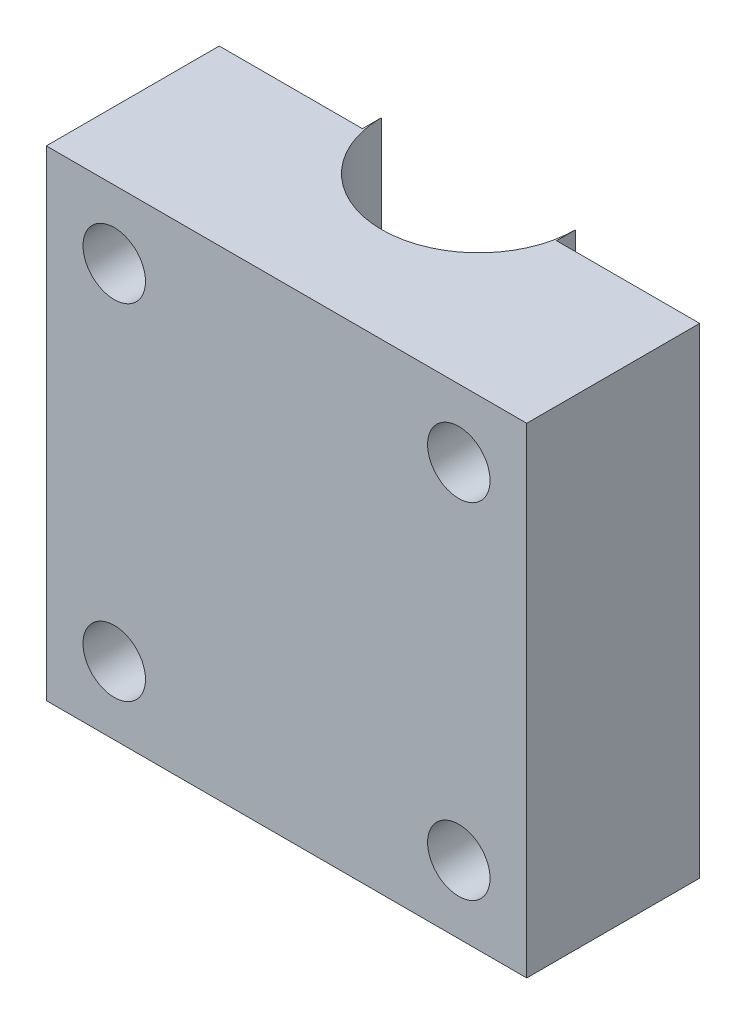
ISO-10303-21;
HEADER;
FILE_DESCRIPTION(('STEP AP214'),'2;1');
FILE_NAME('part.step','',(''),(''),'','','');
FILE_SCHEMA(('AUTOMOTIVE_DESIGN { 1 0 10303 214 1 1 1 1 }'));
ENDSEC;
DATA;
#1=APPLICATION_CONTEXT('core data for automotive mechanical design processes');
#2=APPLICATION_PROTOCOL_DEFINITION('international standard','automotive_design',2000,#1);
#3=PRODUCT_CONTEXT('',#1,'mechanical');
#4=PRODUCT('Part','Part','',(#3));
#5=PRODUCT_RELATED_PRODUCT_CATEGORY('part','',(#4));
#6=PRODUCT_DEFINITION_FORMATION('','',#4);
#7=PRODUCT_DEFINITION_CONTEXT('part definition',#1,'design');
#8=PRODUCT_DEFINITION('design','',#6,#7);
#9=PRODUCT_DEFINITION_SHAPE('','',#8);
#10=(LENGTH_UNIT() NAMED_UNIT(*) SI_UNIT(.MILLI.,.METRE.));
#11=(NAMED_UNIT(*) PLANE_ANGLE_UNIT() SI_UNIT($,.RADIAN.));
#12=(NAMED_UNIT(*) SI_UNIT($,.STERADIAN.) SOLID_ANGLE_UNIT());
#13=UNCERTAINTY_MEASURE_WITH_UNIT(LENGTH_MEASURE(1.E-05),#10,'distance_accuracy_value','');
#14=(GEOMETRIC_REPRESENTATION_CONTEXT(3) GLOBAL_UNCERTAINTY_ASSIGNED_CONTEXT((#13)) GLOBAL_UNIT_ASSIGNED_CONTEXT((#10,
#11,#12)) REPRESENTATION_CONTEXT('',''));
#15=CARTESIAN_POINT('',(0.,0.,0.));
#16=DIRECTION('',(0.,0.,1.));
#17=DIRECTION('',(1.,0.,0.));
#18=AXIS2_PLACEMENT_3D('',#15,#16,#17);
#19=CARTESIAN_POINT('',(-12.5,-12.5,10.));
#20=DIRECTION('',(1.,0.,0.));
#21=DIRECTION('',(0.,0.,-1.));
#22=AXIS2_PLACEMENT_3D('',#19,#20,#21);
#23=PLANE('',#22);
#24=DIRECTION('',(0.,1.,0.));
#25=VECTOR('',#24,1.);
#26=CARTESIAN_POINT('',(-12.5,12.5,1.));
#27=LINE('',#26,#25);
#28=CARTESIAN_POINT('',(-12.5,-12.5,1.));
#29=VERTEX_POINT('',#28);
#30=CARTESIAN_POINT('',(-12.5,12.5,1.));
#31=VERTEX_POINT('',#30);
#32=EDGE_CURVE('E122',#29,#31,#27,.T.);
#33=ORIENTED_EDGE('',*,*,#32,.F.);
#34=DIRECTION('',(0.,0.,-1.));
#35=VECTOR('',#34,1.);
#36=CARTESIAN_POINT('',(-12.5,-12.5,10.));
#37=LINE('',#36,#35);
#38=CARTESIAN_POINT('',(-12.5,-12.5,10.));
#39=VERTEX_POINT('',#38);
#40=EDGE_CURVE('E121',#39,#29,#37,.T.);
#41=ORIENTED_EDGE('',*,*,#40,.F.);
#42=DIRECTION('',(0.,-1.,0.));
#43=VECTOR('',#42,1.);
#44=CARTESIAN_POINT('',(-12.5,-12.5,10.));
#45=LINE('',#44,#43);
#46=CARTESIAN_POINT('',(-12.5,12.5,10.));
#47=VERTEX_POINT('',#46);
#48=EDGE_CURVE('E55',#47,#39,#45,.T.);
#49=ORIENTED_EDGE('',*,*,#48,.F.);
#50=DIRECTION('',(0.,0.,-1.));
#51=VECTOR('',#50,1.);
#52=CARTESIAN_POINT('',(-12.5,12.5,10.));
#53=LINE('',#52,#51);
#54=EDGE_CURVE('E177',#47,#31,#53,.T.);
#55=ORIENTED_EDGE('',*,*,#54,.T.);
#56=EDGE_LOOP('',(#33,#41,#49,#55));
#57=FACE_BOUND('',#56,.T.);
#58=ADVANCED_FACE('F33',(#57),#23,.F.);
#59=CARTESIAN_POINT('',(-8.96446609406727,8.96446609406726,0.));
#60=DIRECTION('',(0.,0.,1.));
#61=DIRECTION('',(1.,0.,0.));
#62=AXIS2_PLACEMENT_3D('',#59,#60,#61);
#63=CYLINDRICAL_SURFACE('',#62,1.625);
#64=CARTESIAN_POINT('',(-8.96446609406727,8.96446609406726,10.));
#65=DIRECTION('',(0.,0.,1.));
#66=DIRECTION('',(1.,0.,0.));
#67=AXIS2_PLACEMENT_3D('',#64,#65,#66);
#68=CIRCLE('',#67,1.625);
#69=CARTESIAN_POINT('',(-7.33946609406727,8.96446609406726,10.));
#70=VERTEX_POINT('',#69);
#71=EDGE_CURVE('E159',#70,#70,#68,.T.);
#72=ORIENTED_EDGE('',*,*,#71,.T.);
#73=EDGE_LOOP('',(#72));
#74=FACE_BOUND('',#73,.T.);
#75=CARTESIAN_POINT('',(-8.96446609406727,8.96446609406726,1.));
#76=DIRECTION('',(0.,0.,-1.));
#77=DIRECTION('',(-1.,0.,0.));
#78=AXIS2_PLACEMENT_3D('',#75,#76,#77);
#79=CIRCLE('',#78,1.625);
#80=CARTESIAN_POINT('',(-10.5894660940673,8.96446609406726,1.));
#81=VERTEX_POINT('',#80);
#82=EDGE_CURVE('E128',#81,#81,#79,.F.);
#83=ORIENTED_EDGE('',*,*,#82,.F.);
#84=EDGE_LOOP('',(#83));
#85=FACE_BOUND('',#84,.T.);
#86=ADVANCED_FACE('F205',(#74,#85),#63,.F.);
#87=CARTESIAN_POINT('',(-8.96446609406727,-8.96446609406727,0.));
#88=DIRECTION('',(0.,0.,1.));
#89=DIRECTION('',(1.,0.,0.));
#90=AXIS2_PLACEMENT_3D('',#87,#88,#89);
#91=CYLINDRICAL_SURFACE('',#90,1.625);
#92=CARTESIAN_POINT('',(-8.96446609406727,-8.96446609406727,10.));
#93=DIRECTION('',(0.,0.,1.));
#94=DIRECTION('',(1.,0.,0.));
#95=AXIS2_PLACEMENT_3D('',#92,#93,#94);
#96=CIRCLE('',#95,1.625);
#97=CARTESIAN_POINT('',(-7.33946609406727,-8.96446609406727,10.));
#98=VERTEX_POINT('',#97);
#99=EDGE_CURVE('E150',#98,#98,#96,.T.);
#100=ORIENTED_EDGE('',*,*,#99,.T.);
#101=EDGE_LOOP('',(#100));
#102=FACE_BOUND('',#101,.T.);
#103=CARTESIAN_POINT('',(-8.96446609406727,-8.96446609406727,1.));
#104=DIRECTION('',(0.,0.,-1.));
#105=DIRECTION('',(-1.,0.,0.));
#106=AXIS2_PLACEMENT_3D('',#103,#104,#105);
#107=CIRCLE('',#106,1.625);
#108=CARTESIAN_POINT('',(-10.5894660940673,-8.96446609406727,1.));
#109=VERTEX_POINT('',#108);
#110=EDGE_CURVE('E37',#109,#109,#107,.F.);
#111=ORIENTED_EDGE('',*,*,#110,.F.);
#112=EDGE_LOOP('',(#111));
#113=FACE_BOUND('',#112,.T.);
#114=ADVANCED_FACE('F211',(#102,#113),#91,.F.);
#115=CARTESIAN_POINT('',(12.5,-12.5,10.));
#116=DIRECTION('',(-1.,0.,0.));
#117=DIRECTION('',(0.,0.,1.));
#118=AXIS2_PLACEMENT_3D('',#115,#116,#117);
#119=PLANE('',#118);
#120=DIRECTION('',(0.,-1.,0.));
#121=VECTOR('',#120,1.);
#122=CARTESIAN_POINT('',(12.5,12.5,1.));
#123=LINE('',#122,#121);
#124=CARTESIAN_POINT('',(12.5,12.5,1.));
#125=VERTEX_POINT('',#124);
#126=CARTESIAN_POINT('',(12.5,-12.5,1.));
#127=VERTEX_POINT('',#126);
#128=EDGE_CURVE('E131',#125,#127,#123,.T.);
#129=ORIENTED_EDGE('',*,*,#128,.F.);
#130=DIRECTION('',(0.,0.,-1.));
#131=VECTOR('',#130,1.);
#132=CARTESIAN_POINT('',(12.5,12.5,10.));
#133=LINE('',#132,#131);
#134=CARTESIAN_POINT('',(12.5,12.5,10.));
#135=VERTEX_POINT('',#134);
#136=EDGE_CURVE('E180',#135,#125,#133,.T.);
#137=ORIENTED_EDGE('',*,*,#136,.F.);
#138=DIRECTION('',(0.,1.,0.));
#139=VECTOR('',#138,1.);
#140=CARTESIAN_POINT('',(12.5,-12.5,10.));
#141=LINE('',#140,#139);
#142=CARTESIAN_POINT('',(12.5,-12.5,10.));
#143=VERTEX_POINT('',#142);
#144=EDGE_CURVE('E165',#143,#135,#141,.T.);
#145=ORIENTED_EDGE('',*,*,#144,.F.);
#146=DIRECTION('',(0.,0.,-1.));
#147=VECTOR('',#146,1.);
#148=CARTESIAN_POINT('',(12.5,-12.5,10.));
#149=LINE('',#148,#147);
#150=EDGE_CURVE('E173',#143,#127,#149,.T.);
#151=ORIENTED_EDGE('',*,*,#150,.T.);
#152=EDGE_LOOP('',(#129,#137,#145,#151));
#153=FACE_BOUND('',#152,.T.);
#154=ADVANCED_FACE('F35',(#153),#119,.F.);
#155=CARTESIAN_POINT('',(8.96446609406726,8.96446609406726,0.));
#156=DIRECTION('',(0.,0.,1.));
#157=DIRECTION('',(1.,0.,0.));
#158=AXIS2_PLACEMENT_3D('',#155,#156,#157);
#159=CYLINDRICAL_SURFACE('',#158,1.625);
#160=CARTESIAN_POINT('',(8.96446609406726,8.96446609406726,10.));
#161=DIRECTION('',(0.,0.,1.));
#162=DIRECTION('',(1.,0.,0.));
#163=AXIS2_PLACEMENT_3D('',#160,#161,#162);
#164=CIRCLE('',#163,1.625);
#165=CARTESIAN_POINT('',(10.5894660940673,8.96446609406726,10.));
#166=VERTEX_POINT('',#165);
#167=EDGE_CURVE('E156',#166,#166,#164,.T.);
#168=ORIENTED_EDGE('',*,*,#167,.T.);
#169=EDGE_LOOP('',(#168));
#170=FACE_BOUND('',#169,.T.);
#171=CARTESIAN_POINT('',(8.96446609406726,8.96446609406726,1.));
#172=DIRECTION('',(0.,0.,-1.));
#173=DIRECTION('',(-1.,0.,0.));
#174=AXIS2_PLACEMENT_3D('',#171,#172,#173);
#175=CIRCLE('',#174,1.625);
#176=CARTESIAN_POINT('',(7.33946609406726,8.96446609406726,1.));
#177=VERTEX_POINT('',#176);
#178=EDGE_CURVE('E147',#177,#177,#175,.F.);
#179=ORIENTED_EDGE('',*,*,#178,.F.);
#180=EDGE_LOOP('',(#179));
#181=FACE_BOUND('',#180,.T.);
#182=ADVANCED_FACE('F193',(#170,#181),#159,.F.);
#183=CARTESIAN_POINT('',(8.96446609406726,-8.96446609406727,0.));
#184=DIRECTION('',(0.,0.,1.));
#185=DIRECTION('',(1.,0.,0.));
#186=AXIS2_PLACEMENT_3D('',#183,#184,#185);
#187=CYLINDRICAL_SURFACE('',#186,1.625);
#188=CARTESIAN_POINT('',(8.96446609406726,-8.96446609406727,10.));
#189=DIRECTION('',(0.,0.,1.));
#190=DIRECTION('',(1.,0.,0.));
#191=AXIS2_PLACEMENT_3D('',#188,#189,#190);
#192=CIRCLE('',#191,1.625);
#193=CARTESIAN_POINT('',(10.5894660940673,-8.96446609406727,10.));
#194=VERTEX_POINT('',#193);
#195=EDGE_CURVE('E153',#194,#194,#192,.T.);
#196=ORIENTED_EDGE('',*,*,#195,.T.);
#197=EDGE_LOOP('',(#196));
#198=FACE_BOUND('',#197,.T.);
#199=CARTESIAN_POINT('',(8.96446609406726,-8.96446609406727,1.));
#200=DIRECTION('',(0.,0.,-1.));
#201=DIRECTION('',(-1.,0.,0.));
#202=AXIS2_PLACEMENT_3D('',#199,#200,#201);
#203=CIRCLE('',#202,1.625);
#204=CARTESIAN_POINT('',(7.33946609406726,-8.96446609406727,1.));
#205=VERTEX_POINT('',#204);
#206=EDGE_CURVE('E145',#205,#205,#203,.F.);
#207=ORIENTED_EDGE('',*,*,#206,.F.);
#208=EDGE_LOOP('',(#207));
#209=FACE_BOUND('',#208,.T.);
#210=ADVANCED_FACE('F190',(#198,#209),#187,.F.);
#211=CARTESIAN_POINT('',(-12.5,12.5,10.));
#212=DIRECTION('',(0.,-1.,0.));
#213=DIRECTION('',(0.,0.,-1.));
#214=AXIS2_PLACEMENT_3D('',#211,#212,#213);
#215=PLANE('',#214);
#216=CARTESIAN_POINT('',(0.,12.5,0.));
#217=DIRECTION('',(0.,1.,0.));
#218=DIRECTION('',(0.,0.,1.));
#219=AXIS2_PLACEMENT_3D('',#216,#217,#218);
#220=CIRCLE('',#219,5.05);
#221=CARTESIAN_POINT('',(-5.05,12.5,0.));
#222=VERTEX_POINT('',#221);
#223=CARTESIAN_POINT('',(5.05,12.5,0.));
#224=VERTEX_POINT('',#223);
#225=EDGE_CURVE('E162',#222,#224,#220,.T.);
#226=ORIENTED_EDGE('',*,*,#225,.F.);
#227=DIRECTION('',(0.,0.,-1.));
#228=VECTOR('',#227,1.);
#229=CARTESIAN_POINT('',(-5.05,12.5,1.));
#230=LINE('',#229,#228);
#231=CARTESIAN_POINT('',(-5.05,12.5,1.));
#232=VERTEX_POINT('',#231);
#233=EDGE_CURVE('E108',#232,#222,#230,.T.);
#234=ORIENTED_EDGE('',*,*,#233,.F.);
#235=DIRECTION('',(1.,0.,0.));
#236=VECTOR('',#235,1.);
#237=CARTESIAN_POINT('',(-5.05,12.5,1.));
#238=LINE('',#237,#236);
#239=EDGE_CURVE('E109',#31,#232,#238,.T.);
#240=ORIENTED_EDGE('',*,*,#239,.F.);
#241=ORIENTED_EDGE('',*,*,#54,.F.);
#242=DIRECTION('',(-1.,0.,0.));
#243=VECTOR('',#242,1.);
#244=CARTESIAN_POINT('',(-12.5,12.5,10.));
#245=LINE('',#244,#243);
#246=EDGE_CURVE('E169',#135,#47,#245,.T.);
#247=ORIENTED_EDGE('',*,*,#246,.F.);
#248=ORIENTED_EDGE('',*,*,#136,.T.);
#249=DIRECTION('',(1.,0.,0.));
#250=VECTOR('',#249,1.);
#251=CARTESIAN_POINT('',(12.5,12.5,1.));
#252=LINE('',#251,#250);
#253=CARTESIAN_POINT('',(5.05,12.5,1.));
#254=VERTEX_POINT('',#253);
#255=EDGE_CURVE('E139',#254,#125,#252,.T.);
#256=ORIENTED_EDGE('',*,*,#255,.F.);
#257=DIRECTION('',(0.,0.,-1.));
#258=VECTOR('',#257,1.);
#259=CARTESIAN_POINT('',(5.05,12.5,1.));
#260=LINE('',#259,#258);
#261=EDGE_CURVE('E142',#254,#224,#260,.T.);
#262=ORIENTED_EDGE('',*,*,#261,.T.);
#263=EDGE_LOOP('',(#226,#234,#240,#241,#247,#248,#256,#262));
#264=FACE_BOUND('',#263,.T.);
#265=ADVANCED_FACE('F192',(#264),#215,.F.);
#266=CARTESIAN_POINT('',(-12.5,-12.5,10.));
#267=DIRECTION('',(0.,1.,0.));
#268=DIRECTION('',(0.,0.,1.));
#269=AXIS2_PLACEMENT_3D('',#266,#267,#268);
#270=PLANE('',#269);
#271=DIRECTION('',(-1.,0.,0.));
#272=VECTOR('',#271,1.);
#273=CARTESIAN_POINT('',(-5.05,-12.5,1.));
#274=LINE('',#273,#272);
#275=CARTESIAN_POINT('',(-5.05,-12.5,1.));
#276=VERTEX_POINT('',#275);
#277=EDGE_CURVE('E114',#276,#29,#274,.T.);
#278=ORIENTED_EDGE('',*,*,#277,.F.);
#279=DIRECTION('',(0.,0.,-1.));
#280=VECTOR('',#279,1.);
#281=CARTESIAN_POINT('',(-5.05,-12.5,1.));
#282=LINE('',#281,#280);
#283=CARTESIAN_POINT('',(-5.05,-12.5,0.));
#284=VERTEX_POINT('',#283);
#285=EDGE_CURVE('E99',#276,#284,#282,.T.);
#286=ORIENTED_EDGE('',*,*,#285,.T.);
#287=CARTESIAN_POINT('',(0.,-12.5,0.));
#288=DIRECTION('',(0.,1.,0.));
#289=DIRECTION('',(0.,0.,1.));
#290=AXIS2_PLACEMENT_3D('',#287,#288,#289);
#291=CIRCLE('',#290,5.05);
#292=CARTESIAN_POINT('',(5.05,-12.5,0.));
#293=VERTEX_POINT('',#292);
#294=EDGE_CURVE('E163',#284,#293,#291,.T.);
#295=ORIENTED_EDGE('',*,*,#294,.T.);
#296=DIRECTION('',(0.,0.,-1.));
#297=VECTOR('',#296,1.);
#298=CARTESIAN_POINT('',(5.05,-12.5,1.));
#299=LINE('',#298,#297);
#300=CARTESIAN_POINT('',(5.05,-12.5,1.));
#301=VERTEX_POINT('',#300);
#302=EDGE_CURVE('E141',#301,#293,#299,.T.);
#303=ORIENTED_EDGE('',*,*,#302,.F.);
#304=DIRECTION('',(-1.,0.,0.));
#305=VECTOR('',#304,1.);
#306=CARTESIAN_POINT('',(12.5,-12.5,1.));
#307=LINE('',#306,#305);
#308=EDGE_CURVE('E133',#127,#301,#307,.T.);
#309=ORIENTED_EDGE('',*,*,#308,.F.);
#310=ORIENTED_EDGE('',*,*,#150,.F.);
#311=DIRECTION('',(1.,0.,0.));
#312=VECTOR('',#311,1.);
#313=CARTESIAN_POINT('',(-12.5,-12.5,10.));
#314=LINE('',#313,#312);
#315=EDGE_CURVE('E50',#39,#143,#314,.T.);
#316=ORIENTED_EDGE('',*,*,#315,.F.);
#317=ORIENTED_EDGE('',*,*,#40,.T.);
#318=EDGE_LOOP('',(#278,#286,#295,#303,#309,#310,#316,#317));
#319=FACE_BOUND('',#318,.T.);
#320=ADVANCED_FACE('F120',(#319),#270,.F.);
#321=CARTESIAN_POINT('',(0.,0.,10.));
#322=DIRECTION('',(0.,0.,-1.));
#323=DIRECTION('',(-1.,0.,0.));
#324=AXIS2_PLACEMENT_3D('',#321,#322,#323);
#325=PLANE('',#324);
#326=ORIENTED_EDGE('',*,*,#99,.F.);
#327=EDGE_LOOP('',(#326));
#328=FACE_BOUND('',#327,.T.);
#329=ORIENTED_EDGE('',*,*,#195,.F.);
#330=EDGE_LOOP('',(#329));
#331=FACE_BOUND('',#330,.T.);
#332=ORIENTED_EDGE('',*,*,#167,.F.);
#333=EDGE_LOOP('',(#332));
#334=FACE_BOUND('',#333,.T.);
#335=ORIENTED_EDGE('',*,*,#71,.F.);
#336=EDGE_LOOP('',(#335));
#337=FACE_BOUND('',#336,.T.);
#338=ORIENTED_EDGE('',*,*,#144,.T.);
#339=ORIENTED_EDGE('',*,*,#246,.T.);
#340=ORIENTED_EDGE('',*,*,#48,.T.);
#341=ORIENTED_EDGE('',*,*,#315,.T.);
#342=EDGE_LOOP('',(#338,#339,#340,#341));
#343=FACE_BOUND('',#342,.T.);
#344=ADVANCED_FACE('F217',(#328,#331,#334,#337,#343),#325,.F.);
#345=CARTESIAN_POINT('',(0.,-12.5,0.));
#346=DIRECTION('',(0.,1.,0.));
#347=DIRECTION('',(0.,0.,1.));
#348=AXIS2_PLACEMENT_3D('',#345,#346,#347);
#349=CYLINDRICAL_SURFACE('',#348,5.05);
#350=DIRECTION('',(0.,1.,0.));
#351=VECTOR('',#350,1.);
#352=CARTESIAN_POINT('',(-5.05,-12.5,0.));
#353=LINE('',#352,#351);
#354=EDGE_CURVE('E11',#284,#222,#353,.T.);
#355=ORIENTED_EDGE('',*,*,#354,.T.);
#356=ORIENTED_EDGE('',*,*,#225,.T.);
#357=DIRECTION('',(0.,1.,0.));
#358=VECTOR('',#357,1.);
#359=CARTESIAN_POINT('',(5.05,-12.5,0.));
#360=LINE('',#359,#358);
#361=EDGE_CURVE('E42',#224,#293,#360,.F.);
#362=ORIENTED_EDGE('',*,*,#361,.T.);
#363=ORIENTED_EDGE('',*,*,#294,.F.);
#364=EDGE_LOOP('',(#355,#356,#362,#363));
#365=FACE_BOUND('',#364,.T.);
#366=ADVANCED_FACE('F220',(#365),#349,.F.);
#367=CARTESIAN_POINT('',(0.,0.,1.));
#368=DIRECTION('',(0.,0.,-1.));
#369=DIRECTION('',(-1.,0.,0.));
#370=AXIS2_PLACEMENT_3D('',#367,#368,#369);
#371=PLANE('',#370);
#372=ORIENTED_EDGE('',*,*,#206,.T.);
#373=EDGE_LOOP('',(#372));
#374=FACE_BOUND('',#373,.T.);
#375=ORIENTED_EDGE('',*,*,#128,.T.);
#376=ORIENTED_EDGE('',*,*,#308,.T.);
#377=DIRECTION('',(0.,1.,0.));
#378=VECTOR('',#377,1.);
#379=CARTESIAN_POINT('',(5.05,12.5,1.));
#380=LINE('',#379,#378);
#381=EDGE_CURVE('E136',#301,#254,#380,.T.);
#382=ORIENTED_EDGE('',*,*,#381,.T.);
#383=ORIENTED_EDGE('',*,*,#255,.T.);
#384=EDGE_LOOP('',(#375,#376,#382,#383));
#385=FACE_BOUND('',#384,.T.);
#386=ORIENTED_EDGE('',*,*,#178,.T.);
#387=EDGE_LOOP('',(#386));
#388=FACE_BOUND('',#387,.T.);
#389=ADVANCED_FACE('F187',(#374,#385,#388),#371,.T.);
#390=CARTESIAN_POINT('',(5.05,12.5,1.));
#391=DIRECTION('',(-1.,0.,0.));
#392=DIRECTION('',(0.,0.,1.));
#393=AXIS2_PLACEMENT_3D('',#390,#391,#392);
#394=PLANE('',#393);
#395=ORIENTED_EDGE('',*,*,#361,.F.);
#396=ORIENTED_EDGE('',*,*,#261,.F.);
#397=ORIENTED_EDGE('',*,*,#381,.F.);
#398=ORIENTED_EDGE('',*,*,#302,.T.);
#399=EDGE_LOOP('',(#395,#396,#397,#398));
#400=FACE_BOUND('',#399,.T.);
#401=ADVANCED_FACE('F227',(#400),#394,.F.);
#402=CARTESIAN_POINT('',(0.,0.,1.));
#403=DIRECTION('',(0.,0.,-1.));
#404=DIRECTION('',(-1.,0.,0.));
#405=AXIS2_PLACEMENT_3D('',#402,#403,#404);
#406=PLANE('',#405);
#407=ORIENTED_EDGE('',*,*,#110,.T.);
#408=EDGE_LOOP('',(#407));
#409=FACE_BOUND('',#408,.T.);
#410=DIRECTION('',(0.,-1.,0.));
#411=VECTOR('',#410,1.);
#412=CARTESIAN_POINT('',(-5.05,12.5,1.));
#413=LINE('',#412,#411);
#414=EDGE_CURVE('E102',#232,#276,#413,.T.);
#415=ORIENTED_EDGE('',*,*,#414,.T.);
#416=ORIENTED_EDGE('',*,*,#277,.T.);
#417=ORIENTED_EDGE('',*,*,#32,.T.);
#418=ORIENTED_EDGE('',*,*,#239,.T.);
#419=EDGE_LOOP('',(#415,#416,#417,#418));
#420=FACE_BOUND('',#419,.T.);
#421=ORIENTED_EDGE('',*,*,#82,.T.);
#422=EDGE_LOOP('',(#421));
#423=FACE_BOUND('',#422,.T.);
#424=ADVANCED_FACE('F112',(#409,#420,#423),#406,.T.);
#425=CARTESIAN_POINT('',(-5.05,12.5,1.));
#426=DIRECTION('',(1.,0.,0.));
#427=DIRECTION('',(0.,0.,-1.));
#428=AXIS2_PLACEMENT_3D('',#425,#426,#427);
#429=PLANE('',#428);
#430=ORIENTED_EDGE('',*,*,#354,.F.);
#431=ORIENTED_EDGE('',*,*,#285,.F.);
#432=ORIENTED_EDGE('',*,*,#414,.F.);
#433=ORIENTED_EDGE('',*,*,#233,.T.);
#434=EDGE_LOOP('',(#430,#431,#432,#433));
#435=FACE_BOUND('',#434,.T.);
#436=ADVANCED_FACE('F101',(#435),#429,.F.);
#437=CLOSED_SHELL('',(#58,#86,#114,#154,#182,#210,#265,#320,#344,#366,#389,#401,#424,#436));
#438=MANIFOLD_SOLID_BREP('B2',#437);
#439=ADVANCED_BREP_SHAPE_REPRESENTATION('',(#18,#438),#14);
#440=SHAPE_DEFINITION_REPRESENTATION(#9,#439);
ENDSEC;
END-ISO-10303-21;
